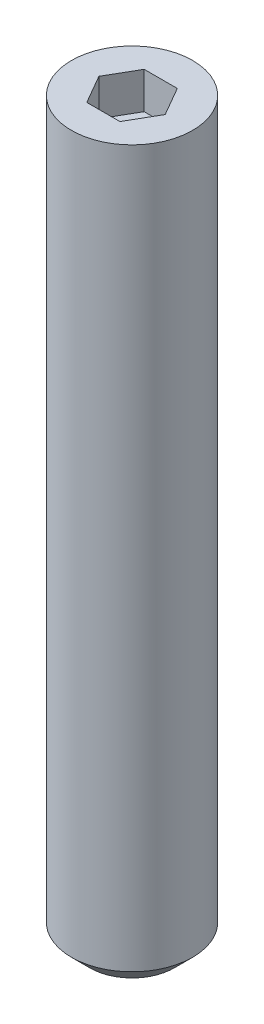
ISO-10303-21;
HEADER;
FILE_DESCRIPTION(('STEP AP214'),'2;1');
FILE_NAME('part.step','',(''),(''),'','','');
FILE_SCHEMA(('AUTOMOTIVE_DESIGN { 1 0 10303 214 1 1 1 1 }'));
ENDSEC;
DATA;
#1=APPLICATION_CONTEXT('core data for automotive mechanical design processes');
#2=APPLICATION_PROTOCOL_DEFINITION('international standard','automotive_design',2000,#1);
#3=PRODUCT_CONTEXT('',#1,'mechanical');
#4=PRODUCT('Part','Part','',(#3));
#5=PRODUCT_RELATED_PRODUCT_CATEGORY('part','',(#4));
#6=PRODUCT_DEFINITION_FORMATION('','',#4);
#7=PRODUCT_DEFINITION_CONTEXT('part definition',#1,'design');
#8=PRODUCT_DEFINITION('design','',#6,#7);
#9=PRODUCT_DEFINITION_SHAPE('','',#8);
#10=(LENGTH_UNIT() NAMED_UNIT(*) SI_UNIT(.MILLI.,.METRE.));
#11=(NAMED_UNIT(*) PLANE_ANGLE_UNIT() SI_UNIT($,.RADIAN.));
#12=(NAMED_UNIT(*) SI_UNIT($,.STERADIAN.) SOLID_ANGLE_UNIT());
#13=UNCERTAINTY_MEASURE_WITH_UNIT(LENGTH_MEASURE(1.E-05),#10,'distance_accuracy_value','');
#14=(GEOMETRIC_REPRESENTATION_CONTEXT(3) GLOBAL_UNCERTAINTY_ASSIGNED_CONTEXT((#13)) GLOBAL_UNIT_ASSIGNED_CONTEXT((#10,
#11,#12)) REPRESENTATION_CONTEXT('',''));
#15=CARTESIAN_POINT('',(0.,0.,0.));
#16=DIRECTION('',(0.,0.,1.));
#17=DIRECTION('',(1.,0.,0.));
#18=AXIS2_PLACEMENT_3D('',#15,#16,#17);
#19=CARTESIAN_POINT('',(-1.14567944042316,11.43,0.));
#20=DIRECTION('',(0.,1.,0.));
#21=DIRECTION('',(0.,0.,1.));
#22=AXIS2_PLACEMENT_3D('',#19,#20,#21);
#23=PLANE('',#22);
#24=DIRECTION('',(-0.5,0.,-0.866025403784438));
#25=VECTOR('',#24,1.);
#26=CARTESIAN_POINT('',(1.14567944042316,11.43,0.));
#27=LINE('',#26,#25);
#28=CARTESIAN_POINT('',(1.14567944042316,11.43,0.));
#29=VERTEX_POINT('',#28);
#30=CARTESIAN_POINT('',(0.572839720211582,11.43,-0.992187499999999));
#31=VERTEX_POINT('',#30);
#32=EDGE_CURVE('E68',#29,#31,#27,.T.);
#33=ORIENTED_EDGE('',*,*,#32,.T.);
#34=DIRECTION('',(-1.,0.,0.));
#35=VECTOR('',#34,1.);
#36=CARTESIAN_POINT('',(0.572839720211582,11.43,-0.992187499999999));
#37=LINE('',#36,#35);
#38=CARTESIAN_POINT('',(-0.572839720211583,11.43,-0.992187499999999));
#39=VERTEX_POINT('',#38);
#40=EDGE_CURVE('E70',#31,#39,#37,.T.);
#41=ORIENTED_EDGE('',*,*,#40,.T.);
#42=DIRECTION('',(-0.5,0.,0.866025403784439));
#43=VECTOR('',#42,1.);
#44=CARTESIAN_POINT('',(-0.572839720211583,11.43,-0.992187499999999));
#45=LINE('',#44,#43);
#46=CARTESIAN_POINT('',(-1.14567944042316,11.43,0.));
#47=VERTEX_POINT('',#46);
#48=EDGE_CURVE('E72',#39,#47,#45,.T.);
#49=ORIENTED_EDGE('',*,*,#48,.T.);
#50=DIRECTION('',(0.500000000000001,0.,0.866025403784438));
#51=VECTOR('',#50,1.);
#52=CARTESIAN_POINT('',(-1.14567944042316,11.43,0.));
#53=LINE('',#52,#51);
#54=CARTESIAN_POINT('',(-0.572839720211581,11.43,0.9921875));
#55=VERTEX_POINT('',#54);
#56=EDGE_CURVE('E118',#47,#55,#53,.T.);
#57=ORIENTED_EDGE('',*,*,#56,.T.);
#58=DIRECTION('',(1.,0.,0.));
#59=VECTOR('',#58,1.);
#60=CARTESIAN_POINT('',(-0.572839720211581,11.43,0.9921875));
#61=LINE('',#60,#59);
#62=CARTESIAN_POINT('',(0.572839720211582,11.43,0.9921875));
#63=VERTEX_POINT('',#62);
#64=EDGE_CURVE('E123',#55,#63,#61,.T.);
#65=ORIENTED_EDGE('',*,*,#64,.T.);
#66=DIRECTION('',(0.5,0.,-0.866025403784439));
#67=VECTOR('',#66,1.);
#68=CARTESIAN_POINT('',(0.572839720211582,11.43,0.9921875));
#69=LINE('',#68,#67);
#70=EDGE_CURVE('E127',#63,#29,#69,.T.);
#71=ORIENTED_EDGE('',*,*,#70,.T.);
#72=EDGE_LOOP('',(#33,#41,#49,#57,#65,#71));
#73=FACE_BOUND('',#72,.T.);
#74=ADVANCED_FACE('F17',(#73),#23,.T.);
#75=CARTESIAN_POINT('',(-0.572839720211583,11.43,-0.992187499999999));
#76=DIRECTION('',(-0.866025403784439,0.,-0.5));
#77=DIRECTION('',(-0.5,0.,0.866025403784439));
#78=AXIS2_PLACEMENT_3D('',#75,#76,#77);
#79=PLANE('',#78);
#80=DIRECTION('',(0.,1.,0.));
#81=VECTOR('',#80,1.);
#82=CARTESIAN_POINT('',(-1.14567944042316,11.43,0.));
#83=LINE('',#82,#81);
#84=CARTESIAN_POINT('',(-1.14567944042316,12.7,0.));
#85=VERTEX_POINT('',#84);
#86=EDGE_CURVE('E83',#85,#47,#83,.F.);
#87=ORIENTED_EDGE('',*,*,#86,.T.);
#88=ORIENTED_EDGE('',*,*,#48,.F.);
#89=DIRECTION('',(0.,1.,0.));
#90=VECTOR('',#89,1.);
#91=CARTESIAN_POINT('',(-0.572839720211583,11.43,-0.992187499999999));
#92=LINE('',#91,#90);
#93=CARTESIAN_POINT('',(-0.572839720211583,12.7,-0.992187499999999));
#94=VERTEX_POINT('',#93);
#95=EDGE_CURVE('E77',#39,#94,#92,.T.);
#96=ORIENTED_EDGE('',*,*,#95,.T.);
#97=DIRECTION('',(0.5,0.,-0.866025403784439));
#98=VECTOR('',#97,1.);
#99=CARTESIAN_POINT('',(-1.14567944042316,12.7,0.));
#100=LINE('',#99,#98);
#101=EDGE_CURVE('E115',#85,#94,#100,.T.);
#102=ORIENTED_EDGE('',*,*,#101,.F.);
#103=EDGE_LOOP('',(#87,#88,#96,#102));
#104=FACE_BOUND('',#103,.T.);
#105=ADVANCED_FACE('F80',(#104),#79,.F.);
#106=CARTESIAN_POINT('',(0.572839720211582,11.43,-0.992187499999999));
#107=DIRECTION('',(0.,0.,-1.));
#108=DIRECTION('',(-1.,0.,0.));
#109=AXIS2_PLACEMENT_3D('',#106,#107,#108);
#110=PLANE('',#109);
#111=ORIENTED_EDGE('',*,*,#95,.F.);
#112=ORIENTED_EDGE('',*,*,#40,.F.);
#113=DIRECTION('',(0.,1.,0.));
#114=VECTOR('',#113,1.);
#115=CARTESIAN_POINT('',(0.572839720211582,11.43,-0.992187499999999));
#116=LINE('',#115,#114);
#117=CARTESIAN_POINT('',(0.572839720211582,12.7,-0.992187499999999));
#118=VERTEX_POINT('',#117);
#119=EDGE_CURVE('E91',#31,#118,#116,.T.);
#120=ORIENTED_EDGE('',*,*,#119,.T.);
#121=DIRECTION('',(1.,0.,0.));
#122=VECTOR('',#121,1.);
#123=CARTESIAN_POINT('',(0.,12.7,-0.992187499999999));
#124=LINE('',#123,#122);
#125=EDGE_CURVE('E88',#94,#118,#124,.T.);
#126=ORIENTED_EDGE('',*,*,#125,.F.);
#127=EDGE_LOOP('',(#111,#112,#120,#126));
#128=FACE_BOUND('',#127,.T.);
#129=ADVANCED_FACE('F86',(#128),#110,.F.);
#130=CARTESIAN_POINT('',(1.14567944042316,11.43,0.));
#131=DIRECTION('',(0.866025403784438,0.,-0.5));
#132=DIRECTION('',(-0.5,0.,-0.866025403784438));
#133=AXIS2_PLACEMENT_3D('',#130,#131,#132);
#134=PLANE('',#133);
#135=ORIENTED_EDGE('',*,*,#119,.F.);
#136=ORIENTED_EDGE('',*,*,#32,.F.);
#137=DIRECTION('',(0.,1.,0.));
#138=VECTOR('',#137,1.);
#139=CARTESIAN_POINT('',(1.14567944042316,11.43,0.));
#140=LINE('',#139,#138);
#141=CARTESIAN_POINT('',(1.14567944042316,12.7,0.));
#142=VERTEX_POINT('',#141);
#143=EDGE_CURVE('E125',#29,#142,#140,.T.);
#144=ORIENTED_EDGE('',*,*,#143,.T.);
#145=DIRECTION('',(0.5,0.,0.866025403784438));
#146=VECTOR('',#145,1.);
#147=CARTESIAN_POINT('',(0.572839720211582,12.7,-0.992187499999999));
#148=LINE('',#147,#146);
#149=EDGE_CURVE('E111',#118,#142,#148,.T.);
#150=ORIENTED_EDGE('',*,*,#149,.F.);
#151=EDGE_LOOP('',(#135,#136,#144,#150));
#152=FACE_BOUND('',#151,.T.);
#153=ADVANCED_FACE('F130',(#152),#134,.F.);
#154=CARTESIAN_POINT('',(0.572839720211582,11.43,0.9921875));
#155=DIRECTION('',(0.866025403784439,0.,0.5));
#156=DIRECTION('',(0.5,0.,-0.866025403784439));
#157=AXIS2_PLACEMENT_3D('',#154,#155,#156);
#158=PLANE('',#157);
#159=ORIENTED_EDGE('',*,*,#143,.F.);
#160=ORIENTED_EDGE('',*,*,#70,.F.);
#161=DIRECTION('',(0.,1.,0.));
#162=VECTOR('',#161,1.);
#163=CARTESIAN_POINT('',(0.572839720211582,11.43,0.9921875));
#164=LINE('',#163,#162);
#165=CARTESIAN_POINT('',(0.572839720211582,12.7,0.9921875));
#166=VERTEX_POINT('',#165);
#167=EDGE_CURVE('E121',#63,#166,#164,.T.);
#168=ORIENTED_EDGE('',*,*,#167,.T.);
#169=DIRECTION('',(-0.5,0.,0.866025403784438));
#170=VECTOR('',#169,1.);
#171=CARTESIAN_POINT('',(1.14567944042316,12.7,0.));
#172=LINE('',#171,#170);
#173=EDGE_CURVE('E106',#142,#166,#172,.T.);
#174=ORIENTED_EDGE('',*,*,#173,.F.);
#175=EDGE_LOOP('',(#159,#160,#168,#174));
#176=FACE_BOUND('',#175,.T.);
#177=ADVANCED_FACE('F140',(#176),#158,.F.);
#178=CARTESIAN_POINT('',(-0.572839720211581,11.43,0.9921875));
#179=DIRECTION('',(0.,0.,1.));
#180=DIRECTION('',(1.,0.,0.));
#181=AXIS2_PLACEMENT_3D('',#178,#179,#180);
#182=PLANE('',#181);
#183=ORIENTED_EDGE('',*,*,#167,.F.);
#184=ORIENTED_EDGE('',*,*,#64,.F.);
#185=DIRECTION('',(0.,1.,0.));
#186=VECTOR('',#185,1.);
#187=CARTESIAN_POINT('',(-0.572839720211581,11.43,0.9921875));
#188=LINE('',#187,#186);
#189=CARTESIAN_POINT('',(-0.572839720211581,12.7,0.9921875));
#190=VERTEX_POINT('',#189);
#191=EDGE_CURVE('E35',#55,#190,#188,.T.);
#192=ORIENTED_EDGE('',*,*,#191,.T.);
#193=DIRECTION('',(1.,0.,0.));
#194=VECTOR('',#193,1.);
#195=CARTESIAN_POINT('',(0.,12.7,0.9921875));
#196=LINE('',#195,#194);
#197=EDGE_CURVE('E102',#166,#190,#196,.F.);
#198=ORIENTED_EDGE('',*,*,#197,.F.);
#199=EDGE_LOOP('',(#183,#184,#192,#198));
#200=FACE_BOUND('',#199,.T.);
#201=ADVANCED_FACE('F138',(#200),#182,.F.);
#202=CARTESIAN_POINT('',(-1.14567944042316,11.43,0.));
#203=DIRECTION('',(-0.866025403784438,0.,0.500000000000001));
#204=DIRECTION('',(0.500000000000001,0.,0.866025403784438));
#205=AXIS2_PLACEMENT_3D('',#202,#203,#204);
#206=PLANE('',#205);
#207=ORIENTED_EDGE('',*,*,#191,.F.);
#208=ORIENTED_EDGE('',*,*,#56,.F.);
#209=ORIENTED_EDGE('',*,*,#86,.F.);
#210=DIRECTION('',(-0.5,0.,-0.866025403784438));
#211=VECTOR('',#210,1.);
#212=CARTESIAN_POINT('',(-0.572839720211581,12.7,0.9921875));
#213=LINE('',#212,#211);
#214=EDGE_CURVE('E98',#190,#85,#213,.T.);
#215=ORIENTED_EDGE('',*,*,#214,.F.);
#216=EDGE_LOOP('',(#207,#208,#209,#215));
#217=FACE_BOUND('',#216,.T.);
#218=ADVANCED_FACE('F135',(#217),#206,.F.);
#219=CARTESIAN_POINT('',(0.,-12.7,0.));
#220=DIRECTION('',(0.,1.,0.));
#221=DIRECTION('',(0.,0.,1.));
#222=AXIS2_PLACEMENT_3D('',#219,#220,#221);
#223=PLANE('',#222);
#224=CARTESIAN_POINT('',(0.,-12.7000000000521,0.));
#225=DIRECTION('',(0.,1.,0.));
#226=DIRECTION('',(0.,0.,1.));
#227=AXIS2_PLACEMENT_3D('',#224,#225,#226);
#228=CIRCLE('',#227,1.46049999995057);
#229=CARTESIAN_POINT('',(0.,-12.7000000000521,1.46049999995057));
#230=VERTEX_POINT('',#229);
#231=EDGE_CURVE('E20',#230,#230,#228,.T.);
#232=ORIENTED_EDGE('',*,*,#231,.F.);
#233=EDGE_LOOP('',(#232));
#234=FACE_BOUND('',#233,.T.);
#235=ADVANCED_FACE('F163',(#234),#223,.F.);
#236=CARTESIAN_POINT('',(0.,12.7,0.));
#237=DIRECTION('',(0.,1.,0.));
#238=DIRECTION('',(0.,0.,1.));
#239=AXIS2_PLACEMENT_3D('',#236,#237,#238);
#240=PLANE('',#239);
#241=CARTESIAN_POINT('',(0.,12.7,0.));
#242=DIRECTION('',(0.,-1.,0.));
#243=DIRECTION('',(0.,0.,-1.));
#244=AXIS2_PLACEMENT_3D('',#241,#242,#243);
#245=CIRCLE('',#244,2.0955);
#246=CARTESIAN_POINT('',(0.,12.7,-2.0955));
#247=VERTEX_POINT('',#246);
#248=EDGE_CURVE('E26',#247,#247,#245,.T.);
#249=ORIENTED_EDGE('',*,*,#248,.F.);
#250=EDGE_LOOP('',(#249));
#251=FACE_BOUND('',#250,.T.);
#252=ORIENTED_EDGE('',*,*,#197,.T.);
#253=ORIENTED_EDGE('',*,*,#214,.T.);
#254=ORIENTED_EDGE('',*,*,#101,.T.);
#255=ORIENTED_EDGE('',*,*,#125,.T.);
#256=ORIENTED_EDGE('',*,*,#149,.T.);
#257=ORIENTED_EDGE('',*,*,#173,.T.);
#258=EDGE_LOOP('',(#252,#253,#254,#255,#256,#257));
#259=FACE_BOUND('',#258,.T.);
#260=ADVANCED_FACE('F133',(#251,#259),#240,.T.);
#261=CARTESIAN_POINT('',(0.,-12.0650000000637,0.));
#262=DIRECTION('',(0.,1.,0.));
#263=DIRECTION('',(0.,0.,1.));
#264=AXIS2_PLACEMENT_3D('',#261,#262,#263);
#265=CONICAL_SURFACE('',#264,2.09549999993897,0.785398163397448);
#266=CARTESIAN_POINT('',(0.,-12.065,0.));
#267=DIRECTION('',(0.,-1.,0.));
#268=DIRECTION('',(0.,0.,-1.));
#269=AXIS2_PLACEMENT_3D('',#266,#267,#268);
#270=CIRCLE('',#269,2.0955);
#271=CARTESIAN_POINT('',(0.,-12.065,-2.0955));
#272=VERTEX_POINT('',#271);
#273=EDGE_CURVE('E10',#272,#272,#270,.F.);
#274=ORIENTED_EDGE('',*,*,#273,.F.);
#275=EDGE_LOOP('',(#274));
#276=FACE_BOUND('',#275,.T.);
#277=ORIENTED_EDGE('',*,*,#231,.T.);
#278=EDGE_LOOP('',(#277));
#279=FACE_BOUND('',#278,.T.);
#280=ADVANCED_FACE('F152',(#276,#279),#265,.T.);
#281=CARTESIAN_POINT('',(0.,12.7,0.));
#282=DIRECTION('',(0.,-1.,0.));
#283=DIRECTION('',(0.,0.,-1.));
#284=AXIS2_PLACEMENT_3D('',#281,#282,#283);
#285=CYLINDRICAL_SURFACE('',#284,2.0955);
#286=ORIENTED_EDGE('',*,*,#248,.T.);
#287=EDGE_LOOP('',(#286));
#288=FACE_BOUND('',#287,.T.);
#289=ORIENTED_EDGE('',*,*,#273,.T.);
#290=EDGE_LOOP('',(#289));
#291=FACE_BOUND('',#290,.T.);
#292=ADVANCED_FACE('F150',(#288,#291),#285,.T.);
#293=CLOSED_SHELL('',(#74,#105,#129,#153,#177,#201,#218,#235,#260,#280,#292));
#294=MANIFOLD_SOLID_BREP('B1',#293);
#295=ADVANCED_BREP_SHAPE_REPRESENTATION('',(#18,#294),#14);
#296=SHAPE_DEFINITION_REPRESENTATION(#9,#295);
ENDSEC;
END-ISO-10303-21;
